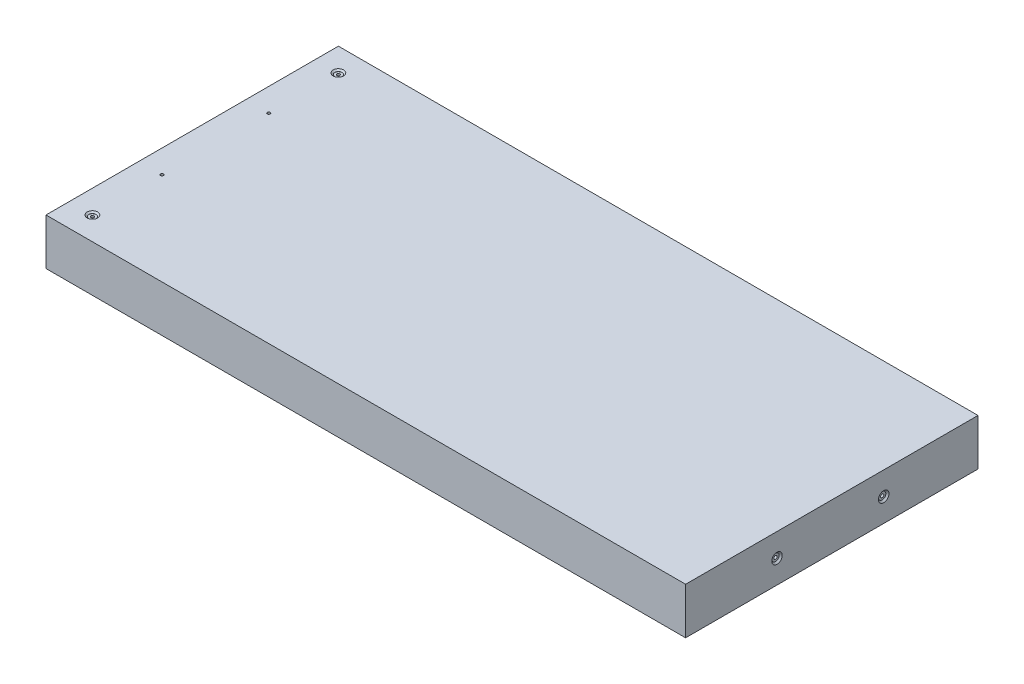
ISO-10303-21;
HEADER;
FILE_DESCRIPTION(('STEP AP214'),'2;1');
FILE_NAME('part.step','',(''),(''),'','','');
FILE_SCHEMA(('AUTOMOTIVE_DESIGN { 1 0 10303 214 1 1 1 1 }'));
ENDSEC;
DATA;
#1=APPLICATION_CONTEXT('core data for automotive mechanical design processes');
#2=APPLICATION_PROTOCOL_DEFINITION('international standard','automotive_design',2000,#1);
#3=PRODUCT_CONTEXT('',#1,'mechanical');
#4=PRODUCT('Part','Part','',(#3));
#5=PRODUCT_RELATED_PRODUCT_CATEGORY('part','',(#4));
#6=PRODUCT_DEFINITION_FORMATION('','',#4);
#7=PRODUCT_DEFINITION_CONTEXT('part definition',#1,'design');
#8=PRODUCT_DEFINITION('design','',#6,#7);
#9=PRODUCT_DEFINITION_SHAPE('','',#8);
#10=(LENGTH_UNIT() NAMED_UNIT(*) SI_UNIT(.MILLI.,.METRE.));
#11=(NAMED_UNIT(*) PLANE_ANGLE_UNIT() SI_UNIT($,.RADIAN.));
#12=(NAMED_UNIT(*) SI_UNIT($,.STERADIAN.) SOLID_ANGLE_UNIT());
#13=UNCERTAINTY_MEASURE_WITH_UNIT(LENGTH_MEASURE(1.E-05),#10,'distance_accuracy_value','');
#14=(GEOMETRIC_REPRESENTATION_CONTEXT(3) GLOBAL_UNCERTAINTY_ASSIGNED_CONTEXT((#13)) GLOBAL_UNIT_ASSIGNED_CONTEXT((#10,
#11,#12)) REPRESENTATION_CONTEXT('',''));
#15=CARTESIAN_POINT('',(0.,0.,0.));
#16=DIRECTION('',(0.,0.,1.));
#17=DIRECTION('',(1.,0.,0.));
#18=AXIS2_PLACEMENT_3D('',#15,#16,#17);
#19=CARTESIAN_POINT('',(175.,25.4,-80.));
#20=DIRECTION('',(-1.,0.,0.));
#21=DIRECTION('',(0.,0.,1.));
#22=AXIS2_PLACEMENT_3D('',#19,#20,#21);
#23=PLANE('',#22);
#24=CARTESIAN_POINT('',(175.,12.7,30.));
#25=DIRECTION('',(1.,0.,0.));
#26=DIRECTION('',(0.,0.,-1.));
#27=AXIS2_PLACEMENT_3D('',#24,#25,#26);
#28=CIRCLE('',#27,2.8575);
#29=CARTESIAN_POINT('',(175.,12.7,27.1425));
#30=VERTEX_POINT('',#29);
#31=EDGE_CURVE('E164',#30,#30,#28,.T.);
#32=ORIENTED_EDGE('',*,*,#31,.F.);
#33=EDGE_LOOP('',(#32));
#34=FACE_BOUND('',#33,.T.);
#35=CARTESIAN_POINT('',(175.,12.7,-28.4));
#36=DIRECTION('',(1.,0.,0.));
#37=DIRECTION('',(0.,0.,-1.));
#38=AXIS2_PLACEMENT_3D('',#35,#36,#37);
#39=CIRCLE('',#38,2.8575);
#40=CARTESIAN_POINT('',(175.,12.7,-31.2575));
#41=VERTEX_POINT('',#40);
#42=EDGE_CURVE('E97',#41,#41,#39,.T.);
#43=ORIENTED_EDGE('',*,*,#42,.F.);
#44=EDGE_LOOP('',(#43));
#45=FACE_BOUND('',#44,.T.);
#46=DIRECTION('',(0.,0.,-1.));
#47=VECTOR('',#46,1.);
#48=CARTESIAN_POINT('',(175.,0.,-80.));
#49=LINE('',#48,#47);
#50=CARTESIAN_POINT('',(175.,0.,80.));
#51=VERTEX_POINT('',#50);
#52=CARTESIAN_POINT('',(175.,0.,-80.));
#53=VERTEX_POINT('',#52);
#54=EDGE_CURVE('E119',#51,#53,#49,.T.);
#55=ORIENTED_EDGE('',*,*,#54,.T.);
#56=DIRECTION('',(0.,-1.,0.));
#57=VECTOR('',#56,1.);
#58=CARTESIAN_POINT('',(175.,25.4,-80.));
#59=LINE('',#58,#57);
#60=CARTESIAN_POINT('',(175.,25.4,-80.));
#61=VERTEX_POINT('',#60);
#62=EDGE_CURVE('E11',#61,#53,#59,.T.);
#63=ORIENTED_EDGE('',*,*,#62,.F.);
#64=DIRECTION('',(0.,0.,-1.));
#65=VECTOR('',#64,1.);
#66=CARTESIAN_POINT('',(175.,25.4,-80.));
#67=LINE('',#66,#65);
#68=CARTESIAN_POINT('',(175.,25.4,80.));
#69=VERTEX_POINT('',#68);
#70=EDGE_CURVE('E120',#69,#61,#67,.T.);
#71=ORIENTED_EDGE('',*,*,#70,.F.);
#72=DIRECTION('',(0.,-1.,0.));
#73=VECTOR('',#72,1.);
#74=CARTESIAN_POINT('',(175.,25.4,80.));
#75=LINE('',#74,#73);
#76=EDGE_CURVE('E126',#69,#51,#75,.T.);
#77=ORIENTED_EDGE('',*,*,#76,.T.);
#78=EDGE_LOOP('',(#55,#63,#71,#77));
#79=FACE_BOUND('',#78,.T.);
#80=ADVANCED_FACE('F33',(#34,#45,#79),#23,.F.);
#81=CARTESIAN_POINT('',(-175.,25.4,-80.));
#82=DIRECTION('',(0.,0.,1.));
#83=DIRECTION('',(1.,0.,0.));
#84=AXIS2_PLACEMENT_3D('',#81,#82,#83);
#85=PLANE('',#84);
#86=DIRECTION('',(-1.,0.,0.));
#87=VECTOR('',#86,1.);
#88=CARTESIAN_POINT('',(-175.,0.,-80.));
#89=LINE('',#88,#87);
#90=CARTESIAN_POINT('',(-175.,0.,-80.));
#91=VERTEX_POINT('',#90);
#92=EDGE_CURVE('E129',#53,#91,#89,.T.);
#93=ORIENTED_EDGE('',*,*,#92,.T.);
#94=DIRECTION('',(0.,-1.,0.));
#95=VECTOR('',#94,1.);
#96=CARTESIAN_POINT('',(-175.,25.4,-80.));
#97=LINE('',#96,#95);
#98=CARTESIAN_POINT('',(-175.,25.4,-80.));
#99=VERTEX_POINT('',#98);
#100=EDGE_CURVE('E41',#99,#91,#97,.T.);
#101=ORIENTED_EDGE('',*,*,#100,.F.);
#102=DIRECTION('',(-1.,0.,0.));
#103=VECTOR('',#102,1.);
#104=CARTESIAN_POINT('',(-175.,25.4,-80.));
#105=LINE('',#104,#103);
#106=EDGE_CURVE('E80',#61,#99,#105,.T.);
#107=ORIENTED_EDGE('',*,*,#106,.F.);
#108=ORIENTED_EDGE('',*,*,#62,.T.);
#109=EDGE_LOOP('',(#93,#101,#107,#108));
#110=FACE_BOUND('',#109,.T.);
#111=ADVANCED_FACE('F153',(#110),#85,.F.);
#112=CARTESIAN_POINT('',(-175.,25.4,-80.));
#113=DIRECTION('',(1.,0.,0.));
#114=DIRECTION('',(0.,0.,-1.));
#115=AXIS2_PLACEMENT_3D('',#112,#113,#114);
#116=PLANE('',#115);
#117=DIRECTION('',(0.,0.,1.));
#118=VECTOR('',#117,1.);
#119=CARTESIAN_POINT('',(-175.,0.,-80.));
#120=LINE('',#119,#118);
#121=CARTESIAN_POINT('',(-175.,0.,80.));
#122=VERTEX_POINT('',#121);
#123=EDGE_CURVE('E67',#91,#122,#120,.T.);
#124=ORIENTED_EDGE('',*,*,#123,.T.);
#125=DIRECTION('',(0.,-1.,0.));
#126=VECTOR('',#125,1.);
#127=CARTESIAN_POINT('',(-175.,25.4,80.));
#128=LINE('',#127,#126);
#129=CARTESIAN_POINT('',(-175.,25.4,80.));
#130=VERTEX_POINT('',#129);
#131=EDGE_CURVE('E134',#130,#122,#128,.T.);
#132=ORIENTED_EDGE('',*,*,#131,.F.);
#133=DIRECTION('',(0.,0.,1.));
#134=VECTOR('',#133,1.);
#135=CARTESIAN_POINT('',(-175.,25.4,-80.));
#136=LINE('',#135,#134);
#137=EDGE_CURVE('E123',#99,#130,#136,.T.);
#138=ORIENTED_EDGE('',*,*,#137,.F.);
#139=ORIENTED_EDGE('',*,*,#100,.T.);
#140=EDGE_LOOP('',(#124,#132,#138,#139));
#141=FACE_BOUND('',#140,.T.);
#142=ADVANCED_FACE('F136',(#141),#116,.F.);
#143=CARTESIAN_POINT('',(-175.,25.4,80.));
#144=DIRECTION('',(0.,0.,-1.));
#145=DIRECTION('',(-1.,0.,0.));
#146=AXIS2_PLACEMENT_3D('',#143,#144,#145);
#147=PLANE('',#146);
#148=DIRECTION('',(1.,0.,0.));
#149=VECTOR('',#148,1.);
#150=CARTESIAN_POINT('',(-175.,0.,80.));
#151=LINE('',#150,#149);
#152=EDGE_CURVE('E73',#122,#51,#151,.T.);
#153=ORIENTED_EDGE('',*,*,#152,.T.);
#154=ORIENTED_EDGE('',*,*,#76,.F.);
#155=DIRECTION('',(1.,0.,0.));
#156=VECTOR('',#155,1.);
#157=CARTESIAN_POINT('',(-175.,25.4,80.));
#158=LINE('',#157,#156);
#159=EDGE_CURVE('E49',#130,#69,#158,.T.);
#160=ORIENTED_EDGE('',*,*,#159,.F.);
#161=ORIENTED_EDGE('',*,*,#131,.T.);
#162=EDGE_LOOP('',(#153,#154,#160,#161));
#163=FACE_BOUND('',#162,.T.);
#164=ADVANCED_FACE('F143',(#163),#147,.F.);
#165=CARTESIAN_POINT('',(0.,25.4,0.));
#166=DIRECTION('',(0.,1.,0.));
#167=DIRECTION('',(0.,0.,1.));
#168=AXIS2_PLACEMENT_3D('',#165,#166,#167);
#169=PLANE('',#168);
#170=CARTESIAN_POINT('',(-162.3,25.4,-29.2));
#171=DIRECTION('',(0.,-1.,0.));
#172=DIRECTION('',(0.,0.,-1.));
#173=AXIS2_PLACEMENT_3D('',#170,#171,#172);
#174=CIRCLE('',#173,0.806449999999986);
#175=CARTESIAN_POINT('',(-162.3,25.4,-30.00645));
#176=VERTEX_POINT('',#175);
#177=EDGE_CURVE('E447',#176,#176,#174,.T.);
#178=ORIENTED_EDGE('',*,*,#177,.T.);
#179=EDGE_LOOP('',(#178));
#180=FACE_BOUND('',#179,.T.);
#181=CARTESIAN_POINT('',(-162.3,25.4,29.2));
#182=DIRECTION('',(0.,-1.,0.));
#183=DIRECTION('',(0.,0.,-1.));
#184=AXIS2_PLACEMENT_3D('',#181,#182,#183);
#185=CIRCLE('',#184,0.806449999999986);
#186=CARTESIAN_POINT('',(-162.3,25.4,28.39355));
#187=VERTEX_POINT('',#186);
#188=EDGE_CURVE('E460',#187,#187,#185,.T.);
#189=ORIENTED_EDGE('',*,*,#188,.T.);
#190=EDGE_LOOP('',(#189));
#191=FACE_BOUND('',#190,.T.);
#192=CARTESIAN_POINT('',(-162.3,25.4,67.3));
#193=DIRECTION('',(0.,1.,0.));
#194=DIRECTION('',(0.,0.,1.));
#195=AXIS2_PLACEMENT_3D('',#192,#193,#194);
#196=CIRCLE('',#195,2.85750000000001);
#197=CARTESIAN_POINT('',(-162.3,25.4,70.1575));
#198=VERTEX_POINT('',#197);
#199=EDGE_CURVE('E463',#198,#198,#196,.T.);
#200=ORIENTED_EDGE('',*,*,#199,.F.);
#201=EDGE_LOOP('',(#200));
#202=FACE_BOUND('',#201,.T.);
#203=CARTESIAN_POINT('',(-162.3,25.4,-67.3));
#204=DIRECTION('',(0.,1.,0.));
#205=DIRECTION('',(0.,0.,1.));
#206=AXIS2_PLACEMENT_3D('',#203,#204,#205);
#207=CIRCLE('',#206,2.85750000000001);
#208=CARTESIAN_POINT('',(-162.3,25.4,-64.4425));
#209=VERTEX_POINT('',#208);
#210=EDGE_CURVE('E476',#209,#209,#207,.T.);
#211=ORIENTED_EDGE('',*,*,#210,.F.);
#212=EDGE_LOOP('',(#211));
#213=FACE_BOUND('',#212,.T.);
#214=ORIENTED_EDGE('',*,*,#70,.T.);
#215=ORIENTED_EDGE('',*,*,#106,.T.);
#216=ORIENTED_EDGE('',*,*,#137,.T.);
#217=ORIENTED_EDGE('',*,*,#159,.T.);
#218=EDGE_LOOP('',(#214,#215,#216,#217));
#219=FACE_BOUND('',#218,.T.);
#220=ADVANCED_FACE('F145',(#180,#191,#202,#213,#219),#169,.T.);
#221=CARTESIAN_POINT('',(0.,0.,0.));
#222=DIRECTION('',(0.,1.,0.));
#223=DIRECTION('',(0.,0.,1.));
#224=AXIS2_PLACEMENT_3D('',#221,#222,#223);
#225=PLANE('',#224);
#226=CARTESIAN_POINT('',(-162.3,0.,-29.2));
#227=DIRECTION('',(0.,-1.,0.));
#228=DIRECTION('',(0.,0.,-1.));
#229=AXIS2_PLACEMENT_3D('',#226,#227,#228);
#230=CIRCLE('',#229,2.85750000000001);
#231=CARTESIAN_POINT('',(-162.3,0.,-32.0575));
#232=VERTEX_POINT('',#231);
#233=EDGE_CURVE('E197',#232,#232,#230,.T.);
#234=ORIENTED_EDGE('',*,*,#233,.F.);
#235=EDGE_LOOP('',(#234));
#236=FACE_BOUND('',#235,.T.);
#237=CARTESIAN_POINT('',(-162.3,0.,29.2));
#238=DIRECTION('',(0.,-1.,0.));
#239=DIRECTION('',(0.,0.,-1.));
#240=AXIS2_PLACEMENT_3D('',#237,#238,#239);
#241=CIRCLE('',#240,2.85750000000001);
#242=CARTESIAN_POINT('',(-162.3,0.,26.3425));
#243=VERTEX_POINT('',#242);
#244=EDGE_CURVE('E201',#243,#243,#241,.T.);
#245=ORIENTED_EDGE('',*,*,#244,.F.);
#246=EDGE_LOOP('',(#245));
#247=FACE_BOUND('',#246,.T.);
#248=CARTESIAN_POINT('',(-162.3,0.,67.3));
#249=DIRECTION('',(0.,1.,0.));
#250=DIRECTION('',(0.,0.,1.));
#251=AXIS2_PLACEMENT_3D('',#248,#249,#250);
#252=CIRCLE('',#251,0.806449999999986);
#253=CARTESIAN_POINT('',(-162.3,0.,68.10645));
#254=VERTEX_POINT('',#253);
#255=EDGE_CURVE('E205',#254,#254,#252,.T.);
#256=ORIENTED_EDGE('',*,*,#255,.T.);
#257=EDGE_LOOP('',(#256));
#258=FACE_BOUND('',#257,.T.);
#259=CARTESIAN_POINT('',(-162.3,0.,-67.3));
#260=DIRECTION('',(0.,1.,0.));
#261=DIRECTION('',(0.,0.,1.));
#262=AXIS2_PLACEMENT_3D('',#259,#260,#261);
#263=CIRCLE('',#262,0.806449999999986);
#264=CARTESIAN_POINT('',(-162.3,0.,-66.49355));
#265=VERTEX_POINT('',#264);
#266=EDGE_CURVE('E208',#265,#265,#263,.T.);
#267=ORIENTED_EDGE('',*,*,#266,.T.);
#268=EDGE_LOOP('',(#267));
#269=FACE_BOUND('',#268,.T.);
#270=ORIENTED_EDGE('',*,*,#54,.F.);
#271=ORIENTED_EDGE('',*,*,#152,.F.);
#272=ORIENTED_EDGE('',*,*,#123,.F.);
#273=ORIENTED_EDGE('',*,*,#92,.F.);
#274=EDGE_LOOP('',(#270,#271,#272,#273));
#275=FACE_BOUND('',#274,.T.);
#276=ADVANCED_FACE('F139',(#236,#247,#258,#269,#275),#225,.F.);
#277=CARTESIAN_POINT('',(145.,12.7,-28.4));
#278=DIRECTION('',(1.,0.,0.));
#279=DIRECTION('',(0.,0.,-1.));
#280=AXIS2_PLACEMENT_3D('',#277,#278,#279);
#281=CONICAL_SURFACE('',#280,0.889000000000001,1.02974425867665);
#282=CARTESIAN_POINT('',(144.465834909685,12.7,-28.4));
#283=VERTEX_POINT('',#282);
#284=VERTEX_LOOP('',#283);
#285=FACE_BOUND('',#284,.T.);
#286=CARTESIAN_POINT('',(145.,12.7,-28.4));
#287=DIRECTION('',(1.,0.,0.));
#288=DIRECTION('',(0.,0.,-1.));
#289=AXIS2_PLACEMENT_3D('',#286,#287,#288);
#290=CIRCLE('',#289,0.889000000000001);
#291=CARTESIAN_POINT('',(145.,12.7,-29.289));
#292=VERTEX_POINT('',#291);
#293=EDGE_CURVE('E116',#292,#292,#290,.T.);
#294=ORIENTED_EDGE('',*,*,#293,.T.);
#295=EDGE_LOOP('',(#294));
#296=FACE_BOUND('',#295,.T.);
#297=ADVANCED_FACE('F186',(#285,#296),#281,.F.);
#298=CARTESIAN_POINT('',(175.,12.7,-28.4));
#299=DIRECTION('',(1.,0.,0.));
#300=DIRECTION('',(0.,0.,-1.));
#301=AXIS2_PLACEMENT_3D('',#298,#299,#300);
#302=CYLINDRICAL_SURFACE('',#301,0.889000000000003);
#303=ORIENTED_EDGE('',*,*,#293,.F.);
#304=EDGE_LOOP('',(#303));
#305=FACE_BOUND('',#304,.T.);
#306=CARTESIAN_POINT('',(174.1872,12.7,-28.4));
#307=DIRECTION('',(1.,0.,0.));
#308=DIRECTION('',(0.,0.,-1.));
#309=AXIS2_PLACEMENT_3D('',#306,#307,#308);
#310=CIRCLE('',#309,0.889000000000004);
#311=CARTESIAN_POINT('',(174.1872,12.7,-29.289));
#312=VERTEX_POINT('',#311);
#313=EDGE_CURVE('E113',#312,#312,#310,.T.);
#314=ORIENTED_EDGE('',*,*,#313,.T.);
#315=EDGE_LOOP('',(#314));
#316=FACE_BOUND('',#315,.T.);
#317=ADVANCED_FACE('F182',(#305,#316),#302,.F.);
#318=CARTESIAN_POINT('',(174.1872,13.589,-28.4));
#319=DIRECTION('',(-1.,0.,0.));
#320=DIRECTION('',(0.,0.,1.));
#321=AXIS2_PLACEMENT_3D('',#318,#319,#320);
#322=PLANE('',#321);
#323=ORIENTED_EDGE('',*,*,#313,.F.);
#324=EDGE_LOOP('',(#323));
#325=FACE_BOUND('',#324,.T.);
#326=CARTESIAN_POINT('',(174.1872,12.7,-28.4));
#327=DIRECTION('',(1.,0.,0.));
#328=DIRECTION('',(0.,0.,-1.));
#329=AXIS2_PLACEMENT_3D('',#326,#327,#328);
#330=CIRCLE('',#329,1.98501);
#331=CARTESIAN_POINT('',(174.1872,12.7,-30.38501));
#332=VERTEX_POINT('',#331);
#333=EDGE_CURVE('E110',#332,#332,#330,.T.);
#334=ORIENTED_EDGE('',*,*,#333,.T.);
#335=EDGE_LOOP('',(#334));
#336=FACE_BOUND('',#335,.T.);
#337=ADVANCED_FACE('F174',(#325,#336),#322,.F.);
#338=CARTESIAN_POINT('',(175.,12.7,-28.4));
#339=DIRECTION('',(1.,0.,0.));
#340=DIRECTION('',(0.,0.,-1.));
#341=AXIS2_PLACEMENT_3D('',#338,#339,#340);
#342=CYLINDRICAL_SURFACE('',#341,1.98501);
#343=ORIENTED_EDGE('',*,*,#333,.F.);
#344=EDGE_LOOP('',(#343));
#345=FACE_BOUND('',#344,.T.);
#346=CARTESIAN_POINT('',(174.12751,12.7,-28.4));
#347=DIRECTION('',(1.,0.,0.));
#348=DIRECTION('',(0.,0.,-1.));
#349=AXIS2_PLACEMENT_3D('',#346,#347,#348);
#350=CIRCLE('',#349,1.98501);
#351=CARTESIAN_POINT('',(174.12751,12.7,-30.38501));
#352=VERTEX_POINT('',#351);
#353=EDGE_CURVE('E101',#352,#352,#350,.T.);
#354=ORIENTED_EDGE('',*,*,#353,.T.);
#355=EDGE_LOOP('',(#354));
#356=FACE_BOUND('',#355,.T.);
#357=ADVANCED_FACE('F168',(#345,#356),#342,.T.);
#358=CARTESIAN_POINT('',(175.,12.7,-28.4));
#359=DIRECTION('',(1.,0.,0.));
#360=DIRECTION('',(0.,0.,-1.));
#361=AXIS2_PLACEMENT_3D('',#358,#359,#360);
#362=CONICAL_SURFACE('',#361,2.8575,0.785398163397446);
#363=ORIENTED_EDGE('',*,*,#353,.F.);
#364=EDGE_LOOP('',(#363));
#365=FACE_BOUND('',#364,.T.);
#366=ORIENTED_EDGE('',*,*,#42,.T.);
#367=EDGE_LOOP('',(#366));
#368=FACE_BOUND('',#367,.T.);
#369=ADVANCED_FACE('F91',(#365,#368),#362,.F.);
#370=CARTESIAN_POINT('',(145.,12.7,30.));
#371=DIRECTION('',(1.,0.,0.));
#372=DIRECTION('',(0.,0.,-1.));
#373=AXIS2_PLACEMENT_3D('',#370,#371,#372);
#374=CONICAL_SURFACE('',#373,0.889000000000001,1.02974425867665);
#375=CARTESIAN_POINT('',(144.465834909685,12.7,30.));
#376=VERTEX_POINT('',#375);
#377=VERTEX_LOOP('',#376);
#378=FACE_BOUND('',#377,.T.);
#379=CARTESIAN_POINT('',(145.,12.7,30.));
#380=DIRECTION('',(1.,0.,0.));
#381=DIRECTION('',(0.,0.,-1.));
#382=AXIS2_PLACEMENT_3D('',#379,#380,#381);
#383=CIRCLE('',#382,0.889000000000001);
#384=CARTESIAN_POINT('',(145.,12.7,29.111));
#385=VERTEX_POINT('',#384);
#386=EDGE_CURVE('E95',#385,#385,#383,.T.);
#387=ORIENTED_EDGE('',*,*,#386,.T.);
#388=EDGE_LOOP('',(#387));
#389=FACE_BOUND('',#388,.T.);
#390=ADVANCED_FACE('F87',(#378,#389),#374,.F.);
#391=CARTESIAN_POINT('',(175.,12.7,30.));
#392=DIRECTION('',(1.,0.,0.));
#393=DIRECTION('',(0.,0.,-1.));
#394=AXIS2_PLACEMENT_3D('',#391,#392,#393);
#395=CYLINDRICAL_SURFACE('',#394,0.889000000000003);
#396=ORIENTED_EDGE('',*,*,#386,.F.);
#397=EDGE_LOOP('',(#396));
#398=FACE_BOUND('',#397,.T.);
#399=CARTESIAN_POINT('',(174.1872,12.7,30.));
#400=DIRECTION('',(1.,0.,0.));
#401=DIRECTION('',(0.,0.,-1.));
#402=AXIS2_PLACEMENT_3D('',#399,#400,#401);
#403=CIRCLE('',#402,0.889000000000004);
#404=CARTESIAN_POINT('',(174.1872,12.7,29.111));
#405=VERTEX_POINT('',#404);
#406=EDGE_CURVE('E98',#405,#405,#403,.T.);
#407=ORIENTED_EDGE('',*,*,#406,.T.);
#408=EDGE_LOOP('',(#407));
#409=FACE_BOUND('',#408,.T.);
#410=ADVANCED_FACE('F90',(#398,#409),#395,.F.);
#411=CARTESIAN_POINT('',(174.1872,13.589,30.));
#412=DIRECTION('',(-1.,0.,0.));
#413=DIRECTION('',(0.,0.,1.));
#414=AXIS2_PLACEMENT_3D('',#411,#412,#413);
#415=PLANE('',#414);
#416=ORIENTED_EDGE('',*,*,#406,.F.);
#417=EDGE_LOOP('',(#416));
#418=FACE_BOUND('',#417,.T.);
#419=CARTESIAN_POINT('',(174.1872,12.7,30.));
#420=DIRECTION('',(1.,0.,0.));
#421=DIRECTION('',(0.,0.,-1.));
#422=AXIS2_PLACEMENT_3D('',#419,#420,#421);
#423=CIRCLE('',#422,1.98501);
#424=CARTESIAN_POINT('',(174.1872,12.7,28.01499));
#425=VERTEX_POINT('',#424);
#426=EDGE_CURVE('E104',#425,#425,#423,.T.);
#427=ORIENTED_EDGE('',*,*,#426,.T.);
#428=EDGE_LOOP('',(#427));
#429=FACE_BOUND('',#428,.T.);
#430=ADVANCED_FACE('F223',(#418,#429),#415,.F.);
#431=CARTESIAN_POINT('',(175.,12.7,30.));
#432=DIRECTION('',(1.,0.,0.));
#433=DIRECTION('',(0.,0.,-1.));
#434=AXIS2_PLACEMENT_3D('',#431,#432,#433);
#435=CYLINDRICAL_SURFACE('',#434,1.98501);
#436=ORIENTED_EDGE('',*,*,#426,.F.);
#437=EDGE_LOOP('',(#436));
#438=FACE_BOUND('',#437,.T.);
#439=CARTESIAN_POINT('',(174.12751,12.7,30.));
#440=DIRECTION('',(1.,0.,0.));
#441=DIRECTION('',(0.,0.,-1.));
#442=AXIS2_PLACEMENT_3D('',#439,#440,#441);
#443=CIRCLE('',#442,1.98501);
#444=CARTESIAN_POINT('',(174.12751,12.7,28.01499));
#445=VERTEX_POINT('',#444);
#446=EDGE_CURVE('E212',#445,#445,#443,.T.);
#447=ORIENTED_EDGE('',*,*,#446,.T.);
#448=EDGE_LOOP('',(#447));
#449=FACE_BOUND('',#448,.T.);
#450=ADVANCED_FACE('F225',(#438,#449),#435,.T.);
#451=CARTESIAN_POINT('',(175.,12.7,30.));
#452=DIRECTION('',(1.,0.,0.));
#453=DIRECTION('',(0.,0.,-1.));
#454=AXIS2_PLACEMENT_3D('',#451,#452,#453);
#455=CONICAL_SURFACE('',#454,2.8575,0.785398163397446);
#456=ORIENTED_EDGE('',*,*,#446,.F.);
#457=EDGE_LOOP('',(#456));
#458=FACE_BOUND('',#457,.T.);
#459=ORIENTED_EDGE('',*,*,#31,.T.);
#460=EDGE_LOOP('',(#459));
#461=FACE_BOUND('',#460,.T.);
#462=ADVANCED_FACE('F228',(#458,#461),#455,.F.);
#463=CARTESIAN_POINT('',(-162.3,25.4,-67.3));
#464=DIRECTION('',(0.,1.,0.));
#465=DIRECTION('',(0.,0.,1.));
#466=AXIS2_PLACEMENT_3D('',#463,#464,#465);
#467=CYLINDRICAL_SURFACE('',#466,0.80645);
#468=ORIENTED_EDGE('',*,*,#266,.F.);
#469=EDGE_LOOP('',(#468));
#470=FACE_BOUND('',#469,.T.);
#471=CARTESIAN_POINT('',(-162.3,24.5872,-67.3));
#472=DIRECTION('',(0.,1.,0.));
#473=DIRECTION('',(0.,0.,1.));
#474=AXIS2_PLACEMENT_3D('',#471,#472,#473);
#475=CIRCLE('',#474,0.806450000000014);
#476=CARTESIAN_POINT('',(-162.3,24.5872,-66.49355));
#477=VERTEX_POINT('',#476);
#478=EDGE_CURVE('E210',#477,#477,#475,.T.);
#479=ORIENTED_EDGE('',*,*,#478,.T.);
#480=EDGE_LOOP('',(#479));
#481=FACE_BOUND('',#480,.T.);
#482=ADVANCED_FACE('F234',(#470,#481),#467,.F.);
#483=CARTESIAN_POINT('',(-160.31499,24.5872,-67.3));
#484=DIRECTION('',(0.,-1.,0.));
#485=DIRECTION('',(0.,0.,-1.));
#486=AXIS2_PLACEMENT_3D('',#483,#484,#485);
#487=PLANE('',#486);
#488=ORIENTED_EDGE('',*,*,#478,.F.);
#489=EDGE_LOOP('',(#488));
#490=FACE_BOUND('',#489,.T.);
#491=CARTESIAN_POINT('',(-162.3,24.5872,-67.3));
#492=DIRECTION('',(0.,1.,0.));
#493=DIRECTION('',(0.,0.,1.));
#494=AXIS2_PLACEMENT_3D('',#491,#492,#493);
#495=CIRCLE('',#494,1.98501000000001);
#496=CARTESIAN_POINT('',(-162.3,24.5872,-65.31499));
#497=VERTEX_POINT('',#496);
#498=EDGE_CURVE('E215',#497,#497,#495,.T.);
#499=ORIENTED_EDGE('',*,*,#498,.T.);
#500=EDGE_LOOP('',(#499));
#501=FACE_BOUND('',#500,.T.);
#502=ADVANCED_FACE('F239',(#490,#501),#487,.F.);
#503=CARTESIAN_POINT('',(-162.3,25.4,-67.3));
#504=DIRECTION('',(0.,1.,0.));
#505=DIRECTION('',(0.,0.,1.));
#506=AXIS2_PLACEMENT_3D('',#503,#504,#505);
#507=CYLINDRICAL_SURFACE('',#506,1.98501000000001);
#508=ORIENTED_EDGE('',*,*,#498,.F.);
#509=EDGE_LOOP('',(#508));
#510=FACE_BOUND('',#509,.T.);
#511=CARTESIAN_POINT('',(-162.3,24.6678939627941,-67.3));
#512=DIRECTION('',(0.,1.,0.));
#513=DIRECTION('',(0.,0.,1.));
#514=AXIS2_PLACEMENT_3D('',#511,#512,#513);
#515=CIRCLE('',#514,1.98501000000001);
#516=CARTESIAN_POINT('',(-162.3,24.6678939627941,-65.31499));
#517=VERTEX_POINT('',#516);
#518=EDGE_CURVE('E479',#517,#517,#515,.T.);
#519=ORIENTED_EDGE('',*,*,#518,.T.);
#520=EDGE_LOOP('',(#519));
#521=FACE_BOUND('',#520,.T.);
#522=ADVANCED_FACE('F279',(#510,#521),#507,.F.);
#523=CARTESIAN_POINT('',(-162.3,25.4,-67.3));
#524=DIRECTION('',(0.,1.,0.));
#525=DIRECTION('',(0.,0.,1.));
#526=AXIS2_PLACEMENT_3D('',#523,#524,#525);
#527=CONICAL_SURFACE('',#526,2.85750000000001,0.872664625997166);
#528=ORIENTED_EDGE('',*,*,#518,.F.);
#529=EDGE_LOOP('',(#528));
#530=FACE_BOUND('',#529,.T.);
#531=ORIENTED_EDGE('',*,*,#210,.T.);
#532=EDGE_LOOP('',(#531));
#533=FACE_BOUND('',#532,.T.);
#534=ADVANCED_FACE('F288',(#530,#533),#527,.F.);
#535=CARTESIAN_POINT('',(-162.3,25.4,67.3));
#536=DIRECTION('',(0.,1.,0.));
#537=DIRECTION('',(0.,0.,1.));
#538=AXIS2_PLACEMENT_3D('',#535,#536,#537);
#539=CYLINDRICAL_SURFACE('',#538,0.80645);
#540=ORIENTED_EDGE('',*,*,#255,.F.);
#541=EDGE_LOOP('',(#540));
#542=FACE_BOUND('',#541,.T.);
#543=CARTESIAN_POINT('',(-162.3,24.5872,67.3));
#544=DIRECTION('',(0.,1.,0.));
#545=DIRECTION('',(0.,0.,1.));
#546=AXIS2_PLACEMENT_3D('',#543,#544,#545);
#547=CIRCLE('',#546,0.806450000000014);
#548=CARTESIAN_POINT('',(-162.3,24.5872,68.10645));
#549=VERTEX_POINT('',#548);
#550=EDGE_CURVE('E472',#549,#549,#547,.T.);
#551=ORIENTED_EDGE('',*,*,#550,.T.);
#552=EDGE_LOOP('',(#551));
#553=FACE_BOUND('',#552,.T.);
#554=ADVANCED_FACE('F298',(#542,#553),#539,.F.);
#555=CARTESIAN_POINT('',(-160.31499,24.5872,67.3));
#556=DIRECTION('',(0.,-1.,0.));
#557=DIRECTION('',(0.,0.,-1.));
#558=AXIS2_PLACEMENT_3D('',#555,#556,#557);
#559=PLANE('',#558);
#560=ORIENTED_EDGE('',*,*,#550,.F.);
#561=EDGE_LOOP('',(#560));
#562=FACE_BOUND('',#561,.T.);
#563=CARTESIAN_POINT('',(-162.3,24.5872,67.3));
#564=DIRECTION('',(0.,1.,0.));
#565=DIRECTION('',(0.,0.,1.));
#566=AXIS2_PLACEMENT_3D('',#563,#564,#565);
#567=CIRCLE('',#566,1.98501000000001);
#568=CARTESIAN_POINT('',(-162.3,24.5872,69.28501));
#569=VERTEX_POINT('',#568);
#570=EDGE_CURVE('E469',#569,#569,#567,.T.);
#571=ORIENTED_EDGE('',*,*,#570,.T.);
#572=EDGE_LOOP('',(#571));
#573=FACE_BOUND('',#572,.T.);
#574=ADVANCED_FACE('F308',(#562,#573),#559,.F.);
#575=CARTESIAN_POINT('',(-162.3,25.4,67.3));
#576=DIRECTION('',(0.,1.,0.));
#577=DIRECTION('',(0.,0.,1.));
#578=AXIS2_PLACEMENT_3D('',#575,#576,#577);
#579=CYLINDRICAL_SURFACE('',#578,1.98501000000001);
#580=ORIENTED_EDGE('',*,*,#570,.F.);
#581=EDGE_LOOP('',(#580));
#582=FACE_BOUND('',#581,.T.);
#583=CARTESIAN_POINT('',(-162.3,24.6678939627941,67.3));
#584=DIRECTION('',(0.,1.,0.));
#585=DIRECTION('',(0.,0.,1.));
#586=AXIS2_PLACEMENT_3D('',#583,#584,#585);
#587=CIRCLE('',#586,1.98501000000001);
#588=CARTESIAN_POINT('',(-162.3,24.6678939627941,69.28501));
#589=VERTEX_POINT('',#588);
#590=EDGE_CURVE('E466',#589,#589,#587,.T.);
#591=ORIENTED_EDGE('',*,*,#590,.T.);
#592=EDGE_LOOP('',(#591));
#593=FACE_BOUND('',#592,.T.);
#594=ADVANCED_FACE('F318',(#582,#593),#579,.F.);
#595=CARTESIAN_POINT('',(-162.3,25.4,67.3));
#596=DIRECTION('',(0.,1.,0.));
#597=DIRECTION('',(0.,0.,1.));
#598=AXIS2_PLACEMENT_3D('',#595,#596,#597);
#599=CONICAL_SURFACE('',#598,2.85750000000001,0.872664625997166);
#600=ORIENTED_EDGE('',*,*,#590,.F.);
#601=EDGE_LOOP('',(#600));
#602=FACE_BOUND('',#601,.T.);
#603=ORIENTED_EDGE('',*,*,#199,.T.);
#604=EDGE_LOOP('',(#603));
#605=FACE_BOUND('',#604,.T.);
#606=ADVANCED_FACE('F328',(#602,#605),#599,.F.);
#607=CARTESIAN_POINT('',(-162.3,0.,29.2));
#608=DIRECTION('',(0.,-1.,0.));
#609=DIRECTION('',(0.,0.,-1.));
#610=AXIS2_PLACEMENT_3D('',#607,#608,#609);
#611=CYLINDRICAL_SURFACE('',#610,0.80645);
#612=ORIENTED_EDGE('',*,*,#188,.F.);
#613=EDGE_LOOP('',(#612));
#614=FACE_BOUND('',#613,.T.);
#615=CARTESIAN_POINT('',(-162.3,0.812799999999992,29.2));
#616=DIRECTION('',(0.,-1.,0.));
#617=DIRECTION('',(0.,0.,-1.));
#618=AXIS2_PLACEMENT_3D('',#615,#616,#617);
#619=CIRCLE('',#618,0.806450000000014);
#620=CARTESIAN_POINT('',(-162.3,0.812799999999992,28.39355));
#621=VERTEX_POINT('',#620);
#622=EDGE_CURVE('E457',#621,#621,#619,.T.);
#623=ORIENTED_EDGE('',*,*,#622,.T.);
#624=EDGE_LOOP('',(#623));
#625=FACE_BOUND('',#624,.T.);
#626=ADVANCED_FACE('F338',(#614,#625),#611,.F.);
#627=CARTESIAN_POINT('',(-160.31499,0.812799999999992,29.2));
#628=DIRECTION('',(0.,1.,0.));
#629=DIRECTION('',(0.,0.,1.));
#630=AXIS2_PLACEMENT_3D('',#627,#628,#629);
#631=PLANE('',#630);
#632=ORIENTED_EDGE('',*,*,#622,.F.);
#633=EDGE_LOOP('',(#632));
#634=FACE_BOUND('',#633,.T.);
#635=CARTESIAN_POINT('',(-162.3,0.812799999999992,29.2));
#636=DIRECTION('',(0.,-1.,0.));
#637=DIRECTION('',(0.,0.,-1.));
#638=AXIS2_PLACEMENT_3D('',#635,#636,#637);
#639=CIRCLE('',#638,1.98501000000001);
#640=CARTESIAN_POINT('',(-162.3,0.812799999999992,27.21499));
#641=VERTEX_POINT('',#640);
#642=EDGE_CURVE('E454',#641,#641,#639,.T.);
#643=ORIENTED_EDGE('',*,*,#642,.T.);
#644=EDGE_LOOP('',(#643));
#645=FACE_BOUND('',#644,.T.);
#646=ADVANCED_FACE('F360',(#634,#645),#631,.F.);
#647=CARTESIAN_POINT('',(-162.3,0.,29.2));
#648=DIRECTION('',(0.,-1.,0.));
#649=DIRECTION('',(0.,0.,-1.));
#650=AXIS2_PLACEMENT_3D('',#647,#648,#649);
#651=CYLINDRICAL_SURFACE('',#650,1.98501000000001);
#652=ORIENTED_EDGE('',*,*,#642,.F.);
#653=EDGE_LOOP('',(#652));
#654=FACE_BOUND('',#653,.T.);
#655=CARTESIAN_POINT('',(-162.3,0.732106037205861,29.2));
#656=DIRECTION('',(0.,-1.,0.));
#657=DIRECTION('',(0.,0.,-1.));
#658=AXIS2_PLACEMENT_3D('',#655,#656,#657);
#659=CIRCLE('',#658,1.98501000000001);
#660=CARTESIAN_POINT('',(-162.3,0.732106037205861,27.21499));
#661=VERTEX_POINT('',#660);
#662=EDGE_CURVE('E451',#661,#661,#659,.T.);
#663=ORIENTED_EDGE('',*,*,#662,.T.);
#664=EDGE_LOOP('',(#663));
#665=FACE_BOUND('',#664,.T.);
#666=ADVANCED_FACE('F370',(#654,#665),#651,.F.);
#667=CARTESIAN_POINT('',(-162.3,0.,29.2));
#668=DIRECTION('',(0.,-1.,0.));
#669=DIRECTION('',(0.,0.,-1.));
#670=AXIS2_PLACEMENT_3D('',#667,#668,#669);
#671=CONICAL_SURFACE('',#670,2.85750000000001,0.872664625997168);
#672=ORIENTED_EDGE('',*,*,#662,.F.);
#673=EDGE_LOOP('',(#672));
#674=FACE_BOUND('',#673,.T.);
#675=ORIENTED_EDGE('',*,*,#244,.T.);
#676=EDGE_LOOP('',(#675));
#677=FACE_BOUND('',#676,.T.);
#678=ADVANCED_FACE('F380',(#674,#677),#671,.F.);
#679=CARTESIAN_POINT('',(-162.3,0.,-29.2));
#680=DIRECTION('',(0.,-1.,0.));
#681=DIRECTION('',(0.,0.,-1.));
#682=AXIS2_PLACEMENT_3D('',#679,#680,#681);
#683=CYLINDRICAL_SURFACE('',#682,0.80645);
#684=ORIENTED_EDGE('',*,*,#177,.F.);
#685=EDGE_LOOP('',(#684));
#686=FACE_BOUND('',#685,.T.);
#687=CARTESIAN_POINT('',(-162.3,0.812799999999992,-29.2));
#688=DIRECTION('',(0.,-1.,0.));
#689=DIRECTION('',(0.,0.,-1.));
#690=AXIS2_PLACEMENT_3D('',#687,#688,#689);
#691=CIRCLE('',#690,0.806450000000014);
#692=CARTESIAN_POINT('',(-162.3,0.812799999999992,-30.00645));
#693=VERTEX_POINT('',#692);
#694=EDGE_CURVE('E444',#693,#693,#691,.T.);
#695=ORIENTED_EDGE('',*,*,#694,.T.);
#696=EDGE_LOOP('',(#695));
#697=FACE_BOUND('',#696,.T.);
#698=ADVANCED_FACE('F390',(#686,#697),#683,.F.);
#699=CARTESIAN_POINT('',(-160.31499,0.812799999999992,-29.2));
#700=DIRECTION('',(0.,1.,0.));
#701=DIRECTION('',(0.,0.,1.));
#702=AXIS2_PLACEMENT_3D('',#699,#700,#701);
#703=PLANE('',#702);
#704=ORIENTED_EDGE('',*,*,#694,.F.);
#705=EDGE_LOOP('',(#704));
#706=FACE_BOUND('',#705,.T.);
#707=CARTESIAN_POINT('',(-162.3,0.812799999999992,-29.2));
#708=DIRECTION('',(0.,-1.,0.));
#709=DIRECTION('',(0.,0.,-1.));
#710=AXIS2_PLACEMENT_3D('',#707,#708,#709);
#711=CIRCLE('',#710,1.98501000000001);
#712=CARTESIAN_POINT('',(-162.3,0.812799999999992,-31.18501));
#713=VERTEX_POINT('',#712);
#714=EDGE_CURVE('E439',#713,#713,#711,.T.);
#715=ORIENTED_EDGE('',*,*,#714,.T.);
#716=EDGE_LOOP('',(#715));
#717=FACE_BOUND('',#716,.T.);
#718=ADVANCED_FACE('F400',(#706,#717),#703,.F.);
#719=CARTESIAN_POINT('',(-162.3,0.,-29.2));
#720=DIRECTION('',(0.,-1.,0.));
#721=DIRECTION('',(0.,0.,-1.));
#722=AXIS2_PLACEMENT_3D('',#719,#720,#721);
#723=CYLINDRICAL_SURFACE('',#722,1.98501000000001);
#724=ORIENTED_EDGE('',*,*,#714,.F.);
#725=EDGE_LOOP('',(#724));
#726=FACE_BOUND('',#725,.T.);
#727=CARTESIAN_POINT('',(-162.3,0.732106037205861,-29.2));
#728=DIRECTION('',(0.,-1.,0.));
#729=DIRECTION('',(0.,0.,-1.));
#730=AXIS2_PLACEMENT_3D('',#727,#728,#729);
#731=CIRCLE('',#730,1.98501000000001);
#732=CARTESIAN_POINT('',(-162.3,0.732106037205861,-31.18501));
#733=VERTEX_POINT('',#732);
#734=EDGE_CURVE('E437',#733,#733,#731,.T.);
#735=ORIENTED_EDGE('',*,*,#734,.T.);
#736=EDGE_LOOP('',(#735));
#737=FACE_BOUND('',#736,.T.);
#738=ADVANCED_FACE('F410',(#726,#737),#723,.F.);
#739=CARTESIAN_POINT('',(-162.3,0.,-29.2));
#740=DIRECTION('',(0.,-1.,0.));
#741=DIRECTION('',(0.,0.,-1.));
#742=AXIS2_PLACEMENT_3D('',#739,#740,#741);
#743=CONICAL_SURFACE('',#742,2.85750000000001,0.872664625997168);
#744=ORIENTED_EDGE('',*,*,#734,.F.);
#745=EDGE_LOOP('',(#744));
#746=FACE_BOUND('',#745,.T.);
#747=ORIENTED_EDGE('',*,*,#233,.T.);
#748=EDGE_LOOP('',(#747));
#749=FACE_BOUND('',#748,.T.);
#750=ADVANCED_FACE('F420',(#746,#749),#743,.F.);
#751=CLOSED_SHELL('',(#80,#111,#142,#164,#220,#276,#297,#317,#337,#357,#369,#390,#410,#430,#450,
#462,#482,#502,#522,#534,#554,#574,#594,#606,#626,#646,#666,#678,#698,#718,#738,#750));
#752=MANIFOLD_SOLID_BREP('B2',#751);
#753=ADVANCED_BREP_SHAPE_REPRESENTATION('',(#18,#752),#14);
#754=SHAPE_DEFINITION_REPRESENTATION(#9,#753);
ENDSEC;
END-ISO-10303-21;
